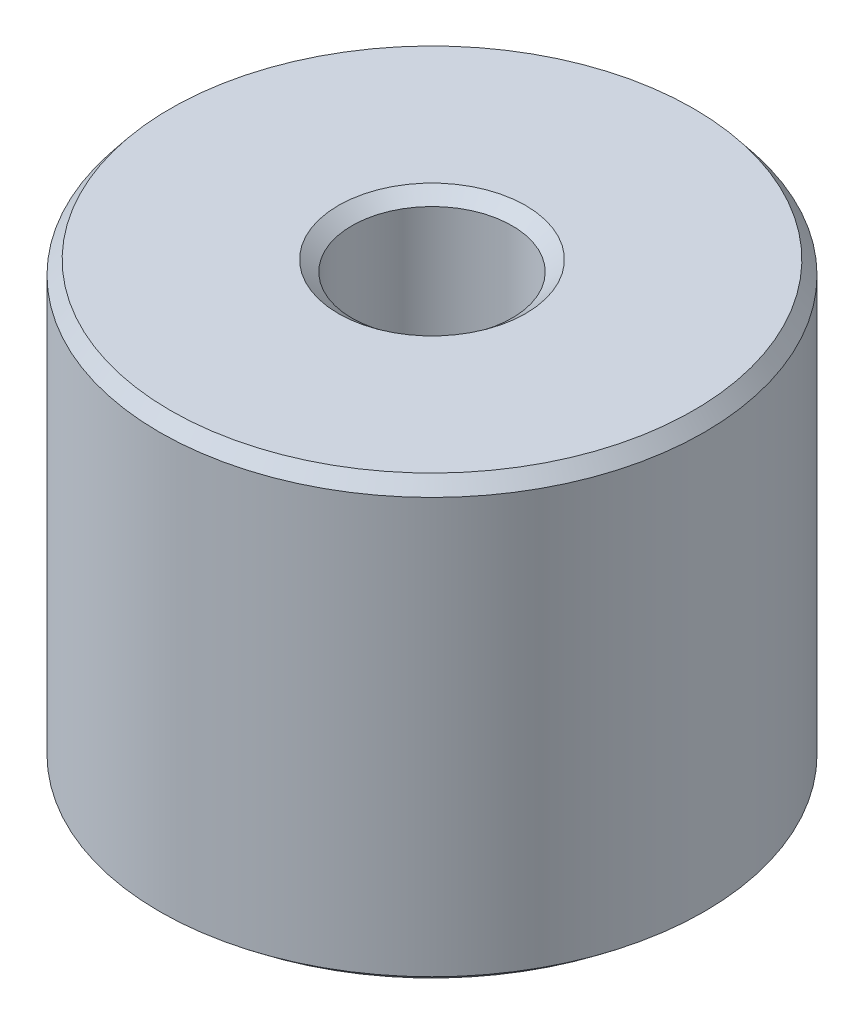
ISO-10303-21;
HEADER;
FILE_DESCRIPTION(('STEP AP214'),'2;1');
FILE_NAME('part.step','',(''),(''),'','','');
FILE_SCHEMA(('AUTOMOTIVE_DESIGN { 1 0 10303 214 1 1 1 1 }'));
ENDSEC;
DATA;
#1=APPLICATION_CONTEXT('core data for automotive mechanical design processes');
#2=APPLICATION_PROTOCOL_DEFINITION('international standard','automotive_design',2000,#1);
#3=PRODUCT_CONTEXT('',#1,'mechanical');
#4=PRODUCT('Part','Part','',(#3));
#5=PRODUCT_RELATED_PRODUCT_CATEGORY('part','',(#4));
#6=PRODUCT_DEFINITION_FORMATION('','',#4);
#7=PRODUCT_DEFINITION_CONTEXT('part definition',#1,'design');
#8=PRODUCT_DEFINITION('design','',#6,#7);
#9=PRODUCT_DEFINITION_SHAPE('','',#8);
#10=(LENGTH_UNIT() NAMED_UNIT(*) SI_UNIT(.MILLI.,.METRE.));
#11=(NAMED_UNIT(*) PLANE_ANGLE_UNIT() SI_UNIT($,.RADIAN.));
#12=(NAMED_UNIT(*) SI_UNIT($,.STERADIAN.) SOLID_ANGLE_UNIT());
#13=UNCERTAINTY_MEASURE_WITH_UNIT(LENGTH_MEASURE(1.E-05),#10,'distance_accuracy_value','');
#14=(GEOMETRIC_REPRESENTATION_CONTEXT(3) GLOBAL_UNCERTAINTY_ASSIGNED_CONTEXT((#13)) GLOBAL_UNIT_ASSIGNED_CONTEXT((#10,
#11,#12)) REPRESENTATION_CONTEXT('',''));
#15=CARTESIAN_POINT('',(0.,0.,0.));
#16=DIRECTION('',(0.,0.,1.));
#17=DIRECTION('',(1.,0.,0.));
#18=AXIS2_PLACEMENT_3D('',#15,#16,#17);
#19=CARTESIAN_POINT('',(0.,12.1029228069438,0.));
#20=DIRECTION('',(0.,-1.,0.));
#21=DIRECTION('',(0.,0.,-1.));
#22=AXIS2_PLACEMENT_3D('',#19,#20,#21);
#23=CYLINDRICAL_SURFACE('',#22,7.5);
#24=CARTESIAN_POINT('',(0.,0.295401027938617,0.));
#25=DIRECTION('',(0.,1.,0.));
#26=DIRECTION('',(0.,0.,1.));
#27=AXIS2_PLACEMENT_3D('',#24,#25,#26);
#28=CIRCLE('',#27,7.5);
#29=CARTESIAN_POINT('',(0.,0.295401027938617,7.5));
#30=VERTEX_POINT('',#29);
#31=EDGE_CURVE('E10',#30,#30,#28,.T.);
#32=ORIENTED_EDGE('',*,*,#31,.T.);
#33=EDGE_LOOP('',(#32));
#34=FACE_BOUND('',#33,.T.);
#35=CARTESIAN_POINT('',(0.,11.7293945165614,0.));
#36=DIRECTION('',(0.,1.,0.));
#37=DIRECTION('',(0.,0.,1.));
#38=AXIS2_PLACEMENT_3D('',#35,#36,#37);
#39=CIRCLE('',#38,7.5);
#40=CARTESIAN_POINT('',(0.,11.7293945165614,-7.5));
#41=VERTEX_POINT('',#40);
#42=EDGE_CURVE('E50',#41,#41,#39,.F.);
#43=ORIENTED_EDGE('',*,*,#42,.T.);
#44=EDGE_LOOP('',(#43));
#45=FACE_BOUND('',#44,.T.);
#46=ADVANCED_FACE('F39',(#34,#45),#23,.T.);
#47=CARTESIAN_POINT('',(0.,12.1029228069438,0.));
#48=DIRECTION('',(0.,1.,0.));
#49=DIRECTION('',(0.,0.,1.));
#50=AXIS2_PLACEMENT_3D('',#47,#48,#49);
#51=PLANE('',#50);
#52=CARTESIAN_POINT('',(0.,12.1029228069438,0.));
#53=DIRECTION('',(0.,1.,0.));
#54=DIRECTION('',(0.,0.,1.));
#55=AXIS2_PLACEMENT_3D('',#52,#53,#54);
#56=CIRCLE('',#55,2.57984225585501);
#57=CARTESIAN_POINT('',(0.,12.1029228069438,2.57984225585501));
#58=VERTEX_POINT('',#57);
#59=EDGE_CURVE('E58',#58,#58,#56,.F.);
#60=ORIENTED_EDGE('',*,*,#59,.T.);
#61=EDGE_LOOP('',(#60));
#62=FACE_BOUND('',#61,.T.);
#63=CARTESIAN_POINT('',(0.,12.1029228069438,0.));
#64=DIRECTION('',(0.,1.,0.));
#65=DIRECTION('',(0.,0.,1.));
#66=AXIS2_PLACEMENT_3D('',#63,#64,#65);
#67=CIRCLE('',#66,7.20459897206139);
#68=CARTESIAN_POINT('',(0.,12.1029228069438,-7.20459897206139));
#69=VERTEX_POINT('',#68);
#70=EDGE_CURVE('E61',#69,#69,#67,.T.);
#71=ORIENTED_EDGE('',*,*,#70,.T.);
#72=EDGE_LOOP('',(#71));
#73=FACE_BOUND('',#72,.T.);
#74=ADVANCED_FACE('F88',(#62,#73),#51,.T.);
#75=CARTESIAN_POINT('',(0.,0.,0.));
#76=DIRECTION('',(0.,1.,0.));
#77=DIRECTION('',(0.,0.,1.));
#78=AXIS2_PLACEMENT_3D('',#75,#76,#77);
#79=PLANE('',#78);
#80=CARTESIAN_POINT('',(0.,0.,0.));
#81=DIRECTION('',(0.,1.,0.));
#82=DIRECTION('',(0.,0.,1.));
#83=AXIS2_PLACEMENT_3D('',#80,#81,#82);
#84=CIRCLE('',#83,2.50171499341123);
#85=CARTESIAN_POINT('',(0.,0.,2.50171499341123));
#86=VERTEX_POINT('',#85);
#87=EDGE_CURVE('E51',#86,#86,#84,.T.);
#88=ORIENTED_EDGE('',*,*,#87,.T.);
#89=EDGE_LOOP('',(#88));
#90=FACE_BOUND('',#89,.T.);
#91=CARTESIAN_POINT('',(0.,0.,0.));
#92=DIRECTION('',(0.,1.,0.));
#93=DIRECTION('',(0.,0.,1.));
#94=AXIS2_PLACEMENT_3D('',#91,#92,#93);
#95=CIRCLE('',#94,7.1264717096176);
#96=CARTESIAN_POINT('',(0.,0.,7.1264717096176));
#97=VERTEX_POINT('',#96);
#98=EDGE_CURVE('E54',#97,#97,#95,.F.);
#99=ORIENTED_EDGE('',*,*,#98,.T.);
#100=EDGE_LOOP('',(#99));
#101=FACE_BOUND('',#100,.T.);
#102=ADVANCED_FACE('F83',(#90,#101),#79,.F.);
#103=CARTESIAN_POINT('',(0.,12.1029228069438,0.));
#104=DIRECTION('',(0.,-1.,0.));
#105=DIRECTION('',(0.,0.,-1.));
#106=AXIS2_PLACEMENT_3D('',#103,#104,#105);
#107=CYLINDRICAL_SURFACE('',#106,2.20631396547261);
#108=CARTESIAN_POINT('',(0.,11.8075217790052,0.));
#109=DIRECTION('',(0.,1.,0.));
#110=DIRECTION('',(0.,0.,1.));
#111=AXIS2_PLACEMENT_3D('',#108,#109,#110);
#112=CIRCLE('',#111,2.20631396547261);
#113=CARTESIAN_POINT('',(0.,11.8075217790052,2.20631396547261));
#114=VERTEX_POINT('',#113);
#115=EDGE_CURVE('E67',#114,#114,#112,.T.);
#116=ORIENTED_EDGE('',*,*,#115,.T.);
#117=EDGE_LOOP('',(#116));
#118=FACE_BOUND('',#117,.T.);
#119=CARTESIAN_POINT('',(0.,0.373528290382398,0.));
#120=DIRECTION('',(0.,1.,0.));
#121=DIRECTION('',(0.,0.,1.));
#122=AXIS2_PLACEMENT_3D('',#119,#120,#121);
#123=CIRCLE('',#122,2.20631396547261);
#124=CARTESIAN_POINT('',(0.,0.373528290382398,2.20631396547261));
#125=VERTEX_POINT('',#124);
#126=EDGE_CURVE('E69',#125,#125,#123,.F.);
#127=ORIENTED_EDGE('',*,*,#126,.T.);
#128=EDGE_LOOP('',(#127));
#129=FACE_BOUND('',#128,.T.);
#130=ADVANCED_FACE('F71',(#118,#129),#107,.F.);
#131=CARTESIAN_POINT('',(0.,11.8075217790052,0.));
#132=DIRECTION('',(0.,1.,0.));
#133=DIRECTION('',(0.,0.,1.));
#134=AXIS2_PLACEMENT_3D('',#131,#132,#133);
#135=CONICAL_SURFACE('',#134,2.20631396547261,0.901665900999349);
#136=ORIENTED_EDGE('',*,*,#59,.F.);
#137=EDGE_LOOP('',(#136));
#138=FACE_BOUND('',#137,.T.);
#139=ORIENTED_EDGE('',*,*,#115,.F.);
#140=EDGE_LOOP('',(#139));
#141=FACE_BOUND('',#140,.T.);
#142=ADVANCED_FACE('F77',(#138,#141),#135,.F.);
#143=CARTESIAN_POINT('',(0.,0.,0.));
#144=DIRECTION('',(0.,-1.,0.));
#145=DIRECTION('',(0.,0.,-1.));
#146=AXIS2_PLACEMENT_3D('',#143,#144,#145);
#147=CONICAL_SURFACE('',#146,2.50171499341123,0.669130425795541);
#148=ORIENTED_EDGE('',*,*,#126,.F.);
#149=EDGE_LOOP('',(#148));
#150=FACE_BOUND('',#149,.T.);
#151=ORIENTED_EDGE('',*,*,#87,.F.);
#152=EDGE_LOOP('',(#151));
#153=FACE_BOUND('',#152,.T.);
#154=ADVANCED_FACE('F73',(#150,#153),#147,.F.);
#155=CARTESIAN_POINT('',(0.,0.295401027938617,0.));
#156=DIRECTION('',(0.,1.,0.));
#157=DIRECTION('',(0.,0.,1.));
#158=AXIS2_PLACEMENT_3D('',#155,#156,#157);
#159=CONICAL_SURFACE('',#158,7.5,0.90166590099935);
#160=ORIENTED_EDGE('',*,*,#98,.F.);
#161=EDGE_LOOP('',(#160));
#162=FACE_BOUND('',#161,.T.);
#163=ORIENTED_EDGE('',*,*,#31,.F.);
#164=EDGE_LOOP('',(#163));
#165=FACE_BOUND('',#164,.T.);
#166=ADVANCED_FACE('F76',(#162,#165),#159,.T.);
#167=CARTESIAN_POINT('',(0.,12.1029228069438,0.));
#168=DIRECTION('',(0.,-1.,0.));
#169=DIRECTION('',(0.,0.,-1.));
#170=AXIS2_PLACEMENT_3D('',#167,#168,#169);
#171=CONICAL_SURFACE('',#170,7.20459897206139,0.669130425795542);
#172=CARTESIAN_POINT('',(0.,11.7293945165614,-7.5));
#173=CARTESIAN_POINT('',(0.,11.7332854362529,-7.49692290595897));
#174=CARTESIAN_POINT('',(0.,11.7371763559444,-7.49384581191795));
#175=CARTESIAN_POINT('',(0.,11.7449581953274,-7.48769162383589));
#176=CARTESIAN_POINT('',(0.,11.7488491150189,-7.48461452979486));
#177=CARTESIAN_POINT('',(0.,11.7566309544018,-7.47846034171281));
#178=CARTESIAN_POINT('',(0.,11.7605218740933,-7.47538324767178));
#179=CARTESIAN_POINT('',(0.,11.7683037134763,-7.46922905958973));
#180=CARTESIAN_POINT('',(0.,11.7721946331678,-7.4661519655487));
#181=CARTESIAN_POINT('',(0.,11.7799764725507,-7.45999777746665));
#182=CARTESIAN_POINT('',(0.,11.7838673922422,-7.45692068342562));
#183=CARTESIAN_POINT('',(0.,11.7916492316252,-7.45076649534357));
#184=CARTESIAN_POINT('',(0.,11.7955401513167,-7.44768940130254));
#185=CARTESIAN_POINT('',(0.,11.8033219906996,-7.44153521322048));
#186=CARTESIAN_POINT('',(0.,11.8072129103911,-7.43845811917946));
#187=CARTESIAN_POINT('',(0.,11.8149947497741,-7.4323039310974));
#188=CARTESIAN_POINT('',(0.,11.8188856694656,-7.42922683705638));
#189=CARTESIAN_POINT('',(0.,11.8266675088485,-7.42307264897432));
#190=CARTESIAN_POINT('',(0.,11.83055842854,-7.41999555493329));
#191=CARTESIAN_POINT('',(0.,11.838340267923,-7.41384136685124));
#192=CARTESIAN_POINT('',(0.,11.8422311876145,-7.41076427281021));
#193=CARTESIAN_POINT('',(0.,11.8500130269974,-7.40461008472816));
#194=CARTESIAN_POINT('',(0.,11.8539039466889,-7.40153299068713));
#195=CARTESIAN_POINT('',(0.,11.8616857860719,-7.39537880260508));
#196=CARTESIAN_POINT('',(0.,11.8655767057634,-7.39230170856405));
#197=CARTESIAN_POINT('',(0.,11.8733585451463,-7.38614752048199));
#198=CARTESIAN_POINT('',(0.,11.8772494648378,-7.38307042644097));
#199=CARTESIAN_POINT('',(0.,11.8850313042208,-7.37691623835891));
#200=CARTESIAN_POINT('',(0.,11.8889222239123,-7.37383914431789));
#201=CARTESIAN_POINT('',(0.,11.8967040632952,-7.36768495623583));
#202=CARTESIAN_POINT('',(0.,11.9005949829867,-7.3646078621948));
#203=CARTESIAN_POINT('',(0.,11.9083768223697,-7.35845367411275));
#204=CARTESIAN_POINT('',(0.,11.9122677420612,-7.35537658007172));
#205=CARTESIAN_POINT('',(0.,11.9200495814441,-7.34922239198967));
#206=CARTESIAN_POINT('',(0.,11.9239405011356,-7.34614529794864));
#207=CARTESIAN_POINT('',(0.,11.9317223405186,-7.33999110986659));
#208=CARTESIAN_POINT('',(0.,11.9356132602101,-7.33691401582556));
#209=CARTESIAN_POINT('',(0.,11.943395099593,-7.3307598277435));
#210=CARTESIAN_POINT('',(0.,11.9472860192845,-7.32768273370248));
#211=CARTESIAN_POINT('',(0.,11.9550678586675,-7.32152854562042));
#212=CARTESIAN_POINT('',(0.,11.958958778359,-7.3184514515794));
#213=CARTESIAN_POINT('',(0.,11.9667406177419,-7.31229726349734));
#214=CARTESIAN_POINT('',(0.,11.9706315374334,-7.30922016945631));
#215=CARTESIAN_POINT('',(0.,11.9784133768164,-7.30306598137426));
#216=CARTESIAN_POINT('',(0.,11.9823042965079,-7.29998888733323));
#217=CARTESIAN_POINT('',(0.,11.9900861358908,-7.29383469925118));
#218=CARTESIAN_POINT('',(0.,11.9939770555823,-7.29075760521015));
#219=CARTESIAN_POINT('',(0.,12.0017588949653,-7.2846034171281));
#220=CARTESIAN_POINT('',(0.,12.0056498146568,-7.28152632308707));
#221=CARTESIAN_POINT('',(0.,12.0134316540397,-7.27537213500502));
#222=CARTESIAN_POINT('',(0.,12.0173225737312,-7.27229504096399));
#223=CARTESIAN_POINT('',(0.,12.0251044131142,-7.26614085288193));
#224=CARTESIAN_POINT('',(0.,12.0289953328057,-7.26306375884091));
#225=CARTESIAN_POINT('',(0.,12.0367771721886,-7.25690957075885));
#226=CARTESIAN_POINT('',(0.,12.0406680918801,-7.25383247671783));
#227=CARTESIAN_POINT('',(0.,12.0484499312631,-7.24767828863577));
#228=CARTESIAN_POINT('',(0.,12.0523408509546,-7.24460119459474));
#229=CARTESIAN_POINT('',(0.,12.0601226903375,-7.23844700651269));
#230=CARTESIAN_POINT('',(0.,12.064013610029,-7.23536991247166));
#231=CARTESIAN_POINT('',(0.,12.071795449412,-7.22921572438961));
#232=CARTESIAN_POINT('',(0.,12.0756863691035,-7.22613863034858));
#233=CARTESIAN_POINT('',(0.,12.0834682084864,-7.21998444226653));
#234=CARTESIAN_POINT('',(0.,12.0873591281779,-7.2169073482255));
#235=CARTESIAN_POINT('',(0.,12.0951409675609,-7.21075316014344));
#236=CARTESIAN_POINT('',(0.,12.0990318872524,-7.20767606610242));
#237=CARTESIAN_POINT('',(0.,12.1029228069438,-7.20459897206139));
#238=B_SPLINE_CURVE_WITH_KNOTS('',3,(#172,#173,#174,#175,#176,#177,#178,#179,#180,#181,#182,
#183,#184,#185,#186,#187,#188,#189,#190,#191,#192,#193,#194,#195,#196,#197,#198,#199,#200,#201,
#202,#203,#204,#205,#206,#207,#208,#209,#210,#211,#212,#213,#214,#215,#216,#217,#218,#219,#220,
#221,#222,#223,#224,#225,#226,#227,#228,#229,#230,#231,#232,#233,#234,#235,#236,#237),
.UNSPECIFIED.,.F.,.F.,(4,2,2,2,2,2,2,2,2,2,2,2,2,2,2,2,2,2,2,2,2,2,2,2,2,2,2,2,2,2,2,2,4),(0.,
0.0148818639305057,0.0297637278610108,0.0446455917915165,0.0595274557220216,0.0744093196525273,
0.0892911835830324,0.104173047513538,0.119054911444043,0.133936775374549,0.148818639305054,
0.16370050323556,0.178582367166065,0.193464231096571,0.208346095027076,0.223227958957581,
0.238109822888086,0.252991686818592,0.267873550749097,0.282755414679603,0.297637278610108,
0.312519142540614,0.327401006471119,0.342282870401625,0.357164734332131,0.372046598262637,
0.386928462193142,0.401810326123648,0.416692190054153,0.431574053984659,0.446455917915164,
0.46133778184567,0.476219645776175),.UNSPECIFIED.);
#239=EDGE_CURVE('BSEAM45',#41,#69,#238,.T.);
#240=ORIENTED_EDGE('',*,*,#42,.F.);
#241=ORIENTED_EDGE('',*,*,#70,.F.);
#242=ORIENTED_EDGE('',*,*,#239,.T.);
#243=ORIENTED_EDGE('',*,*,#239,.F.);
#244=EDGE_LOOP('',(#240,#242,#241,#243));
#245=FACE_BOUND('',#244,.T.);
#246=ADVANCED_FACE('F45',(#245),#171,.T.);
#247=CLOSED_SHELL('',(#46,#74,#102,#130,#142,#154,#166,#246));
#248=MANIFOLD_SOLID_BREP('B2',#247);
#249=ADVANCED_BREP_SHAPE_REPRESENTATION('',(#18,#248),#14);
#250=SHAPE_DEFINITION_REPRESENTATION(#9,#249);
ENDSEC;
END-ISO-10303-21;
